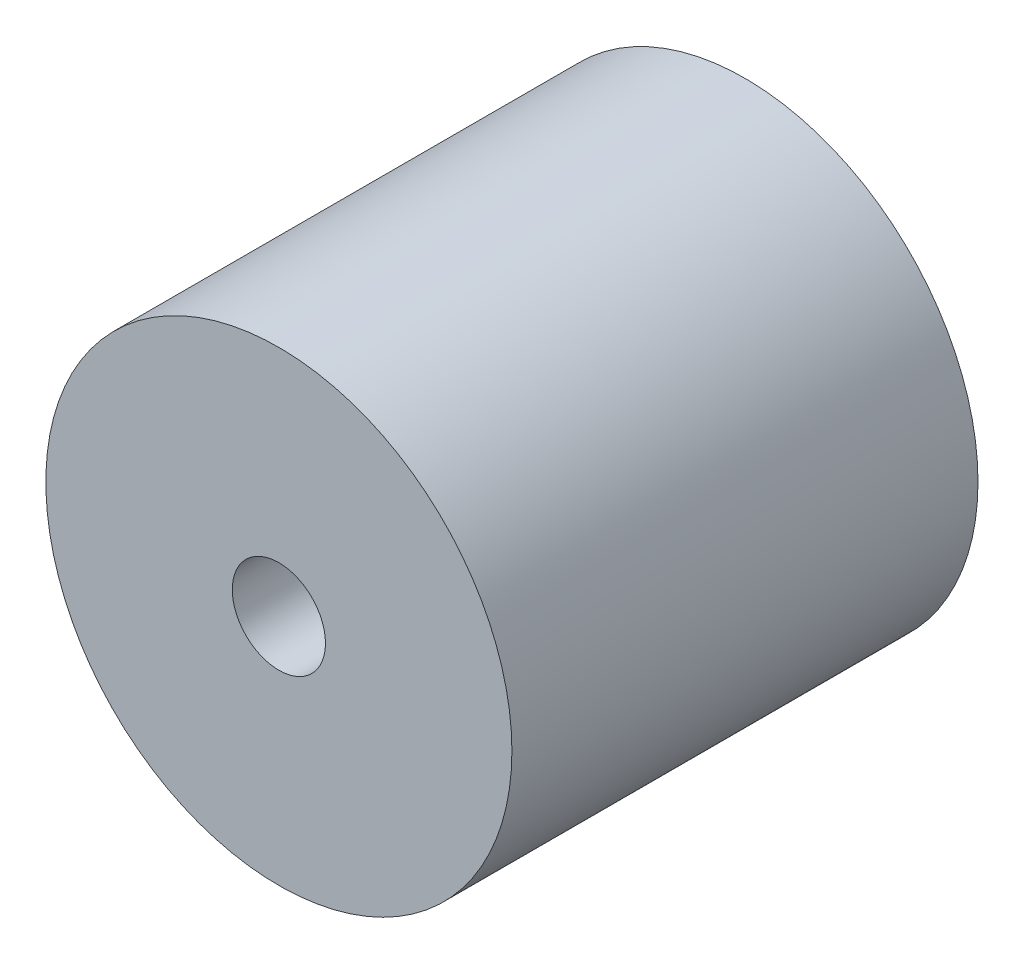
ISO-10303-21;
HEADER;
FILE_DESCRIPTION(('STEP AP214'),'2;1');
FILE_NAME('part.step','',(''),(''),'','','');
FILE_SCHEMA(('AUTOMOTIVE_DESIGN { 1 0 10303 214 1 1 1 1 }'));
ENDSEC;
DATA;
#1=APPLICATION_CONTEXT('core data for automotive mechanical design processes');
#2=APPLICATION_PROTOCOL_DEFINITION('international standard','automotive_design',2000,#1);
#3=PRODUCT_CONTEXT('',#1,'mechanical');
#4=PRODUCT('Part','Part','',(#3));
#5=PRODUCT_RELATED_PRODUCT_CATEGORY('part','',(#4));
#6=PRODUCT_DEFINITION_FORMATION('','',#4);
#7=PRODUCT_DEFINITION_CONTEXT('part definition',#1,'design');
#8=PRODUCT_DEFINITION('design','',#6,#7);
#9=PRODUCT_DEFINITION_SHAPE('','',#8);
#10=(LENGTH_UNIT() NAMED_UNIT(*) SI_UNIT(.MILLI.,.METRE.));
#11=(NAMED_UNIT(*) PLANE_ANGLE_UNIT() SI_UNIT($,.RADIAN.));
#12=(NAMED_UNIT(*) SI_UNIT($,.STERADIAN.) SOLID_ANGLE_UNIT());
#13=UNCERTAINTY_MEASURE_WITH_UNIT(LENGTH_MEASURE(1.E-05),#10,'distance_accuracy_value','');
#14=(GEOMETRIC_REPRESENTATION_CONTEXT(3) GLOBAL_UNCERTAINTY_ASSIGNED_CONTEXT((#13)) GLOBAL_UNIT_ASSIGNED_CONTEXT((#10,
#11,#12)) REPRESENTATION_CONTEXT('',''));
#15=CARTESIAN_POINT('',(0.,0.,0.));
#16=DIRECTION('',(0.,0.,1.));
#17=DIRECTION('',(1.,0.,0.));
#18=AXIS2_PLACEMENT_3D('',#15,#16,#17);
#19=CARTESIAN_POINT('',(0.,0.,1.));
#20=DIRECTION('',(0.,0.,1.));
#21=DIRECTION('',(1.,0.,0.));
#22=AXIS2_PLACEMENT_3D('',#19,#20,#21);
#23=PLANE('',#22);
#24=CARTESIAN_POINT('',(0.,0.,1.));
#25=DIRECTION('',(0.,0.,1.));
#26=DIRECTION('',(1.,0.,0.));
#27=AXIS2_PLACEMENT_3D('',#24,#25,#26);
#28=CIRCLE('',#27,0.5);
#29=CARTESIAN_POINT('',(0.5,0.,1.));
#30=VERTEX_POINT('',#29);
#31=EDGE_CURVE('E10',#30,#30,#28,.T.);
#32=ORIENTED_EDGE('',*,*,#31,.T.);
#33=EDGE_LOOP('',(#32));
#34=FACE_BOUND('',#33,.T.);
#35=CARTESIAN_POINT('',(0.,0.,1.));
#36=DIRECTION('',(0.,0.,1.));
#37=DIRECTION('',(1.,0.,0.));
#38=AXIS2_PLACEMENT_3D('',#35,#36,#37);
#39=CIRCLE('',#38,0.1);
#40=CARTESIAN_POINT('',(0.1,0.,1.));
#41=VERTEX_POINT('',#40);
#42=EDGE_CURVE('E43',#41,#41,#39,.T.);
#43=ORIENTED_EDGE('',*,*,#42,.F.);
#44=EDGE_LOOP('',(#43));
#45=FACE_BOUND('',#44,.T.);
#46=ADVANCED_FACE('F32',(#34,#45),#23,.T.);
#47=CARTESIAN_POINT('',(0.,0.,0.));
#48=DIRECTION('',(0.,0.,1.));
#49=DIRECTION('',(1.,0.,0.));
#50=AXIS2_PLACEMENT_3D('',#47,#48,#49);
#51=PLANE('',#50);
#52=CARTESIAN_POINT('',(0.,0.,0.));
#53=DIRECTION('',(0.,0.,1.));
#54=DIRECTION('',(1.,0.,0.));
#55=AXIS2_PLACEMENT_3D('',#52,#53,#54);
#56=CIRCLE('',#55,0.5);
#57=CARTESIAN_POINT('',(0.5,0.,0.));
#58=VERTEX_POINT('',#57);
#59=EDGE_CURVE('E36',#58,#58,#56,.T.);
#60=ORIENTED_EDGE('',*,*,#59,.F.);
#61=EDGE_LOOP('',(#60));
#62=FACE_BOUND('',#61,.T.);
#63=CARTESIAN_POINT('',(0.,0.,0.));
#64=DIRECTION('',(0.,0.,1.));
#65=DIRECTION('',(1.,0.,0.));
#66=AXIS2_PLACEMENT_3D('',#63,#64,#65);
#67=CIRCLE('',#66,0.1);
#68=CARTESIAN_POINT('',(0.1,0.,0.));
#69=VERTEX_POINT('',#68);
#70=EDGE_CURVE('E45',#69,#69,#67,.T.);
#71=ORIENTED_EDGE('',*,*,#70,.T.);
#72=EDGE_LOOP('',(#71));
#73=FACE_BOUND('',#72,.T.);
#74=ADVANCED_FACE('F55',(#62,#73),#51,.F.);
#75=CARTESIAN_POINT('',(0.,0.,1.));
#76=DIRECTION('',(0.,0.,-1.));
#77=DIRECTION('',(-1.,0.,0.));
#78=AXIS2_PLACEMENT_3D('',#75,#76,#77);
#79=CYLINDRICAL_SURFACE('',#78,0.5);
#80=ORIENTED_EDGE('',*,*,#31,.F.);
#81=EDGE_LOOP('',(#80));
#82=FACE_BOUND('',#81,.T.);
#83=ORIENTED_EDGE('',*,*,#59,.T.);
#84=EDGE_LOOP('',(#83));
#85=FACE_BOUND('',#84,.T.);
#86=ADVANCED_FACE('F34',(#82,#85),#79,.T.);
#87=CARTESIAN_POINT('',(0.,0.,1.));
#88=DIRECTION('',(0.,0.,-1.));
#89=DIRECTION('',(-1.,0.,0.));
#90=AXIS2_PLACEMENT_3D('',#87,#88,#89);
#91=CYLINDRICAL_SURFACE('',#90,0.1);
#92=ORIENTED_EDGE('',*,*,#42,.T.);
#93=EDGE_LOOP('',(#92));
#94=FACE_BOUND('',#93,.T.);
#95=ORIENTED_EDGE('',*,*,#70,.F.);
#96=EDGE_LOOP('',(#95));
#97=FACE_BOUND('',#96,.T.);
#98=ADVANCED_FACE('F51',(#94,#97),#91,.F.);
#99=CLOSED_SHELL('',(#46,#74,#86,#98));
#100=MANIFOLD_SOLID_BREP('B2',#99);
#101=ADVANCED_BREP_SHAPE_REPRESENTATION('',(#18,#100),#14);
#102=SHAPE_DEFINITION_REPRESENTATION(#9,#101);
ENDSEC;
END-ISO-10303-21;
